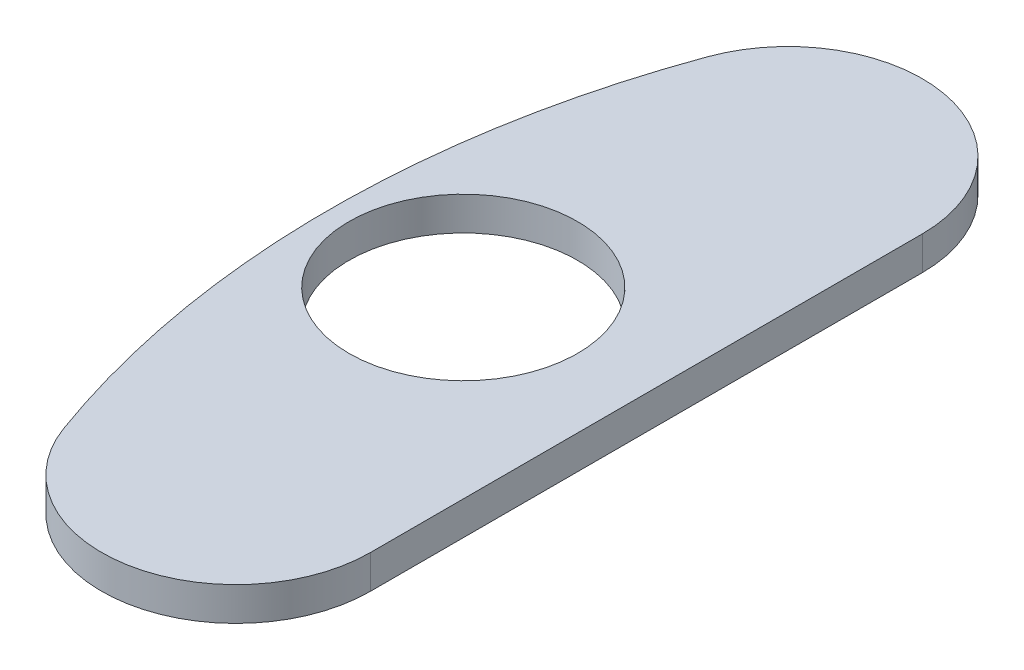
ISO-10303-21;
HEADER;
FILE_DESCRIPTION(('STEP AP214'),'2;1');
FILE_NAME('part.step','',(''),(''),'','','');
FILE_SCHEMA(('AUTOMOTIVE_DESIGN { 1 0 10303 214 1 1 1 1 }'));
ENDSEC;
DATA;
#1=APPLICATION_CONTEXT('core data for automotive mechanical design processes');
#2=APPLICATION_PROTOCOL_DEFINITION('international standard','automotive_design',2000,#1);
#3=PRODUCT_CONTEXT('',#1,'mechanical');
#4=PRODUCT('Part','Part','',(#3));
#5=PRODUCT_RELATED_PRODUCT_CATEGORY('part','',(#4));
#6=PRODUCT_DEFINITION_FORMATION('','',#4);
#7=PRODUCT_DEFINITION_CONTEXT('part definition',#1,'design');
#8=PRODUCT_DEFINITION('design','',#6,#7);
#9=PRODUCT_DEFINITION_SHAPE('','',#8);
#10=(LENGTH_UNIT() NAMED_UNIT(*) SI_UNIT(.MILLI.,.METRE.));
#11=(NAMED_UNIT(*) PLANE_ANGLE_UNIT() SI_UNIT($,.RADIAN.));
#12=(NAMED_UNIT(*) SI_UNIT($,.STERADIAN.) SOLID_ANGLE_UNIT());
#13=UNCERTAINTY_MEASURE_WITH_UNIT(LENGTH_MEASURE(1.E-05),#10,'distance_accuracy_value','');
#14=(GEOMETRIC_REPRESENTATION_CONTEXT(3) GLOBAL_UNCERTAINTY_ASSIGNED_CONTEXT((#13)) GLOBAL_UNIT_ASSIGNED_CONTEXT((#10,
#11,#12)) REPRESENTATION_CONTEXT('',''));
#15=CARTESIAN_POINT('',(0.,0.,0.));
#16=DIRECTION('',(0.,0.,1.));
#17=DIRECTION('',(1.,0.,0.));
#18=AXIS2_PLACEMENT_3D('',#15,#16,#17);
#19=CARTESIAN_POINT('',(-71.6045777038862,3.175,-26.061934921416));
#20=DIRECTION('',(0.,-1.,0.));
#21=DIRECTION('',(0.,0.,-1.));
#22=AXIS2_PLACEMENT_3D('',#19,#20,#21);
#23=PLANE('',#22);
#24=CARTESIAN_POINT('',(-71.6045777038862,3.175,-26.061934921416));
#25=DIRECTION('',(0.,1.,0.));
#26=DIRECTION('',(0.,0.,-1.));
#27=AXIS2_PLACEMENT_3D('',#24,#25,#26);
#28=CIRCLE('',#27,12.7);
#29=CARTESIAN_POINT('',(-58.9045777038862,3.175,-26.061934921416));
#30=VERTEX_POINT('',#29);
#31=CARTESIAN_POINT('',(-83.5386739878672,3.175,-30.405590741652));
#32=VERTEX_POINT('',#31);
#33=EDGE_CURVE('E89',#30,#32,#28,.T.);
#34=ORIENTED_EDGE('',*,*,#33,.T.);
#35=CARTESIAN_POINT('',(0.,3.175,0.));
#36=DIRECTION('',(0.,1.,0.));
#37=DIRECTION('',(0.,0.,1.));
#38=AXIS2_PLACEMENT_3D('',#35,#36,#37);
#39=CIRCLE('',#38,88.9);
#40=CARTESIAN_POINT('',(-83.5386739878672,3.175,30.405590741652));
#41=VERTEX_POINT('',#40);
#42=EDGE_CURVE('E84',#32,#41,#39,.T.);
#43=ORIENTED_EDGE('',*,*,#42,.T.);
#44=CARTESIAN_POINT('',(-71.6045777038862,3.175,26.061934921416));
#45=DIRECTION('',(0.,1.,0.));
#46=DIRECTION('',(0.,0.,1.));
#47=AXIS2_PLACEMENT_3D('',#44,#45,#46);
#48=CIRCLE('',#47,12.7);
#49=CARTESIAN_POINT('',(-58.9045777038862,3.175,26.061934921416));
#50=VERTEX_POINT('',#49);
#51=EDGE_CURVE('E87',#41,#50,#48,.T.);
#52=ORIENTED_EDGE('',*,*,#51,.T.);
#53=DIRECTION('',(0.,0.,-1.));
#54=VECTOR('',#53,1.);
#55=CARTESIAN_POINT('',(-58.9045777038862,3.175,-26.061934921416));
#56=LINE('',#55,#54);
#57=EDGE_CURVE('E54',#50,#30,#56,.T.);
#58=ORIENTED_EDGE('',*,*,#57,.T.);
#59=EDGE_LOOP('',(#34,#43,#52,#58));
#60=FACE_BOUND('',#59,.T.);
#61=CARTESIAN_POINT('',(-76.2,3.175,0.));
#62=DIRECTION('',(0.,1.,0.));
#63=DIRECTION('',(0.,0.,1.));
#64=AXIS2_PLACEMENT_3D('',#61,#62,#63);
#65=CIRCLE('',#64,10.795);
#66=CARTESIAN_POINT('',(-76.2,3.175,10.795));
#67=VERTEX_POINT('',#66);
#68=EDGE_CURVE('E104',#67,#67,#65,.T.);
#69=ORIENTED_EDGE('',*,*,#68,.F.);
#70=EDGE_LOOP('',(#69));
#71=FACE_BOUND('',#70,.T.);
#72=ADVANCED_FACE('F37',(#60,#71),#23,.F.);
#73=CARTESIAN_POINT('',(-71.6045777038862,0.,-26.061934921416));
#74=DIRECTION('',(0.,-1.,0.));
#75=DIRECTION('',(0.,0.,-1.));
#76=AXIS2_PLACEMENT_3D('',#73,#74,#75);
#77=PLANE('',#76);
#78=CARTESIAN_POINT('',(-71.6045777038862,0.,-26.061934921416));
#79=DIRECTION('',(0.,1.,0.));
#80=DIRECTION('',(0.,0.,-1.));
#81=AXIS2_PLACEMENT_3D('',#78,#79,#80);
#82=CIRCLE('',#81,12.7);
#83=CARTESIAN_POINT('',(-58.9045777038862,0.,-26.061934921416));
#84=VERTEX_POINT('',#83);
#85=CARTESIAN_POINT('',(-83.5386739878672,0.,-30.405590741652));
#86=VERTEX_POINT('',#85);
#87=EDGE_CURVE('E101',#84,#86,#82,.T.);
#88=ORIENTED_EDGE('',*,*,#87,.F.);
#89=DIRECTION('',(0.,0.,-1.));
#90=VECTOR('',#89,1.);
#91=CARTESIAN_POINT('',(-58.9045777038862,0.,-26.061934921416));
#92=LINE('',#91,#90);
#93=CARTESIAN_POINT('',(-58.9045777038862,0.,26.061934921416));
#94=VERTEX_POINT('',#93);
#95=EDGE_CURVE('E77',#94,#84,#92,.T.);
#96=ORIENTED_EDGE('',*,*,#95,.F.);
#97=CARTESIAN_POINT('',(-71.6045777038862,0.,26.061934921416));
#98=DIRECTION('',(0.,1.,0.));
#99=DIRECTION('',(0.,0.,1.));
#100=AXIS2_PLACEMENT_3D('',#97,#98,#99);
#101=CIRCLE('',#100,12.7);
#102=CARTESIAN_POINT('',(-83.5386739878672,0.,30.405590741652));
#103=VERTEX_POINT('',#102);
#104=EDGE_CURVE('E71',#103,#94,#101,.T.);
#105=ORIENTED_EDGE('',*,*,#104,.F.);
#106=CARTESIAN_POINT('',(0.,0.,0.));
#107=DIRECTION('',(0.,1.,0.));
#108=DIRECTION('',(0.,0.,1.));
#109=AXIS2_PLACEMENT_3D('',#106,#107,#108);
#110=CIRCLE('',#109,88.9);
#111=EDGE_CURVE('E93',#86,#103,#110,.T.);
#112=ORIENTED_EDGE('',*,*,#111,.F.);
#113=EDGE_LOOP('',(#88,#96,#105,#112));
#114=FACE_BOUND('',#113,.T.);
#115=CARTESIAN_POINT('',(-76.2,0.,0.));
#116=DIRECTION('',(0.,1.,0.));
#117=DIRECTION('',(0.,0.,1.));
#118=AXIS2_PLACEMENT_3D('',#115,#116,#117);
#119=CIRCLE('',#118,10.795);
#120=CARTESIAN_POINT('',(-76.2,0.,10.795));
#121=VERTEX_POINT('',#120);
#122=EDGE_CURVE('E116',#121,#121,#119,.T.);
#123=ORIENTED_EDGE('',*,*,#122,.T.);
#124=EDGE_LOOP('',(#123));
#125=FACE_BOUND('',#124,.T.);
#126=ADVANCED_FACE('F112',(#114,#125),#77,.T.);
#127=CARTESIAN_POINT('',(-71.6045777038862,3.175,-26.061934921416));
#128=DIRECTION('',(0.,-1.,0.));
#129=DIRECTION('',(0.,0.,-1.));
#130=AXIS2_PLACEMENT_3D('',#127,#128,#129);
#131=CYLINDRICAL_SURFACE('',#130,12.7);
#132=ORIENTED_EDGE('',*,*,#87,.T.);
#133=DIRECTION('',(0.,-1.,0.));
#134=VECTOR('',#133,1.);
#135=CARTESIAN_POINT('',(-83.5386739878672,3.175,-30.405590741652));
#136=LINE('',#135,#134);
#137=EDGE_CURVE('E11',#32,#86,#136,.T.);
#138=ORIENTED_EDGE('',*,*,#137,.F.);
#139=ORIENTED_EDGE('',*,*,#33,.F.);
#140=DIRECTION('',(0.,-1.,0.));
#141=VECTOR('',#140,1.);
#142=CARTESIAN_POINT('',(-58.9045777038862,3.175,-26.061934921416));
#143=LINE('',#142,#141);
#144=EDGE_CURVE('E97',#30,#84,#143,.T.);
#145=ORIENTED_EDGE('',*,*,#144,.T.);
#146=EDGE_LOOP('',(#132,#138,#139,#145));
#147=FACE_BOUND('',#146,.T.);
#148=ADVANCED_FACE('F39',(#147),#131,.T.);
#149=CARTESIAN_POINT('',(0.,3.175,0.));
#150=DIRECTION('',(0.,-1.,0.));
#151=DIRECTION('',(0.,0.,-1.));
#152=AXIS2_PLACEMENT_3D('',#149,#150,#151);
#153=CYLINDRICAL_SURFACE('',#152,88.9);
#154=ORIENTED_EDGE('',*,*,#111,.T.);
#155=DIRECTION('',(0.,-1.,0.));
#156=VECTOR('',#155,1.);
#157=CARTESIAN_POINT('',(-83.5386739878672,3.175,30.405590741652));
#158=LINE('',#157,#156);
#159=EDGE_CURVE('E46',#41,#103,#158,.T.);
#160=ORIENTED_EDGE('',*,*,#159,.F.);
#161=ORIENTED_EDGE('',*,*,#42,.F.);
#162=ORIENTED_EDGE('',*,*,#137,.T.);
#163=EDGE_LOOP('',(#154,#160,#161,#162));
#164=FACE_BOUND('',#163,.T.);
#165=ADVANCED_FACE('F92',(#164),#153,.T.);
#166=CARTESIAN_POINT('',(-71.6045777038862,3.175,26.061934921416));
#167=DIRECTION('',(0.,-1.,0.));
#168=DIRECTION('',(0.,0.,-1.));
#169=AXIS2_PLACEMENT_3D('',#166,#167,#168);
#170=CYLINDRICAL_SURFACE('',#169,12.7);
#171=ORIENTED_EDGE('',*,*,#104,.T.);
#172=DIRECTION('',(0.,-1.,0.));
#173=VECTOR('',#172,1.);
#174=CARTESIAN_POINT('',(-58.9045777038862,3.175,26.061934921416));
#175=LINE('',#174,#173);
#176=EDGE_CURVE('E94',#50,#94,#175,.T.);
#177=ORIENTED_EDGE('',*,*,#176,.F.);
#178=ORIENTED_EDGE('',*,*,#51,.F.);
#179=ORIENTED_EDGE('',*,*,#159,.T.);
#180=EDGE_LOOP('',(#171,#177,#178,#179));
#181=FACE_BOUND('',#180,.T.);
#182=ADVANCED_FACE('F95',(#181),#170,.T.);
#183=CARTESIAN_POINT('',(-58.9045777038862,3.175,-26.061934921416));
#184=DIRECTION('',(-1.,0.,0.));
#185=DIRECTION('',(0.,0.,1.));
#186=AXIS2_PLACEMENT_3D('',#183,#184,#185);
#187=PLANE('',#186);
#188=ORIENTED_EDGE('',*,*,#95,.T.);
#189=ORIENTED_EDGE('',*,*,#144,.F.);
#190=ORIENTED_EDGE('',*,*,#57,.F.);
#191=ORIENTED_EDGE('',*,*,#176,.T.);
#192=EDGE_LOOP('',(#188,#189,#190,#191));
#193=FACE_BOUND('',#192,.T.);
#194=ADVANCED_FACE('F109',(#193),#187,.F.);
#195=CARTESIAN_POINT('',(-76.2,3.175,0.));
#196=DIRECTION('',(0.,-1.,0.));
#197=DIRECTION('',(0.,0.,-1.));
#198=AXIS2_PLACEMENT_3D('',#195,#196,#197);
#199=CYLINDRICAL_SURFACE('',#198,10.795);
#200=ORIENTED_EDGE('',*,*,#68,.T.);
#201=EDGE_LOOP('',(#200));
#202=FACE_BOUND('',#201,.T.);
#203=ORIENTED_EDGE('',*,*,#122,.F.);
#204=EDGE_LOOP('',(#203));
#205=FACE_BOUND('',#204,.T.);
#206=ADVANCED_FACE('F122',(#202,#205),#199,.F.);
#207=CLOSED_SHELL('',(#72,#126,#148,#165,#182,#194,#206));
#208=MANIFOLD_SOLID_BREP('B2',#207);
#209=ADVANCED_BREP_SHAPE_REPRESENTATION('',(#18,#208),#14);
#210=SHAPE_DEFINITION_REPRESENTATION(#9,#209);
ENDSEC;
END-ISO-10303-21;
